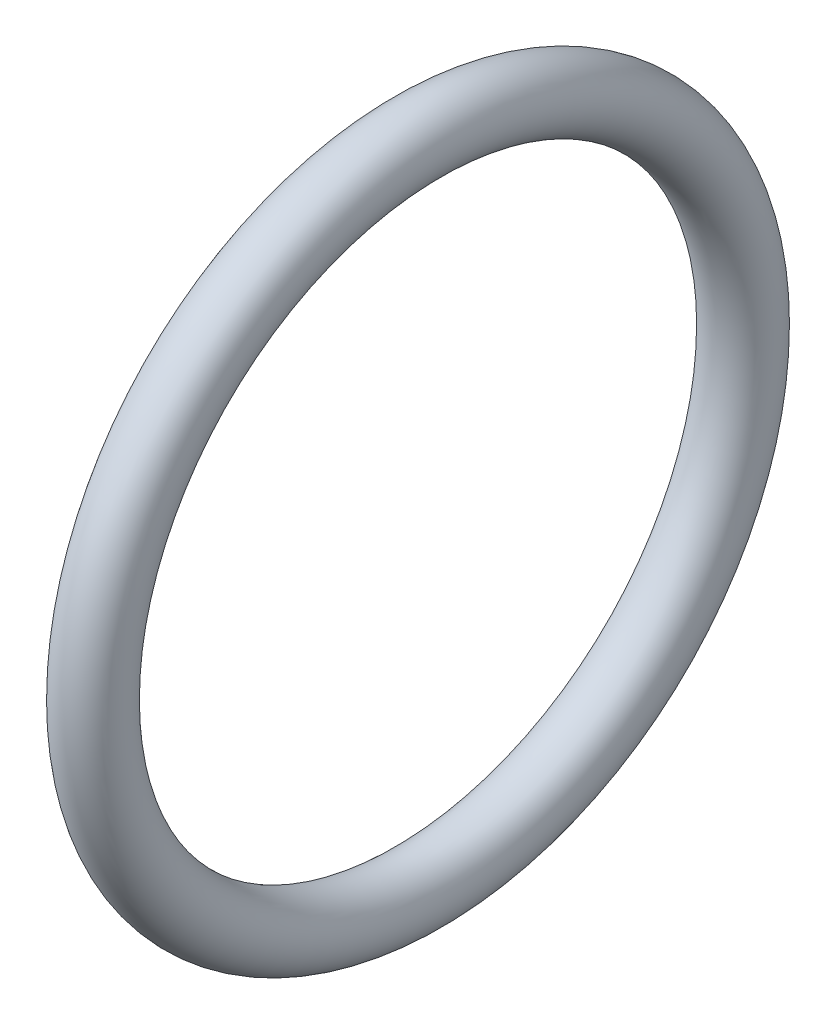
ISO-10303-21;
HEADER;
FILE_DESCRIPTION(('STEP AP214'),'2;1');
FILE_NAME('part.step','',(''),(''),'','','');
FILE_SCHEMA(('AUTOMOTIVE_DESIGN { 1 0 10303 214 1 1 1 1 }'));
ENDSEC;
DATA;
#1=APPLICATION_CONTEXT('core data for automotive mechanical design processes');
#2=APPLICATION_PROTOCOL_DEFINITION('international standard','automotive_design',2000,#1);
#3=PRODUCT_CONTEXT('',#1,'mechanical');
#4=PRODUCT('Part','Part','',(#3));
#5=PRODUCT_RELATED_PRODUCT_CATEGORY('part','',(#4));
#6=PRODUCT_DEFINITION_FORMATION('','',#4);
#7=PRODUCT_DEFINITION_CONTEXT('part definition',#1,'design');
#8=PRODUCT_DEFINITION('design','',#6,#7);
#9=PRODUCT_DEFINITION_SHAPE('','',#8);
#10=(LENGTH_UNIT() NAMED_UNIT(*) SI_UNIT(.MILLI.,.METRE.));
#11=(NAMED_UNIT(*) PLANE_ANGLE_UNIT() SI_UNIT($,.RADIAN.));
#12=(NAMED_UNIT(*) SI_UNIT($,.STERADIAN.) SOLID_ANGLE_UNIT());
#13=UNCERTAINTY_MEASURE_WITH_UNIT(LENGTH_MEASURE(1.E-05),#10,'distance_accuracy_value','');
#14=(GEOMETRIC_REPRESENTATION_CONTEXT(3) GLOBAL_UNCERTAINTY_ASSIGNED_CONTEXT((#13)) GLOBAL_UNIT_ASSIGNED_CONTEXT((#10,
#11,#12)) REPRESENTATION_CONTEXT('',''));
#15=CARTESIAN_POINT('',(0.,0.,0.));
#16=DIRECTION('',(0.,0.,1.));
#17=DIRECTION('',(1.,0.,0.));
#18=AXIS2_PLACEMENT_3D('',#15,#16,#17);
#19=CARTESIAN_POINT('',(9.24147546652135,0.,0.));
#20=DIRECTION('',(1.,0.,0.));
#21=DIRECTION('',(0.,0.,-1.));
#22=AXIS2_PLACEMENT_3D('',#19,#20,#21);
#23=TOROIDAL_SURFACE('',#22,8.79961556748914,0.889000000000001);
#24=CARTESIAN_POINT('',(9.24147546652135,0.,-9.68861556748914));
#25=VERTEX_POINT('',#24);
#26=VERTEX_LOOP('',#25);
#27=FACE_BOUND('',#26,.T.);
#28=ADVANCED_FACE('F12',(#27),#23,.T.);
#29=CLOSED_SHELL('',(#28));
#30=MANIFOLD_SOLID_BREP('B1',#29);
#31=ADVANCED_BREP_SHAPE_REPRESENTATION('',(#18,#30),#14);
#32=SHAPE_DEFINITION_REPRESENTATION(#9,#31);
ENDSEC;
END-ISO-10303-21;
